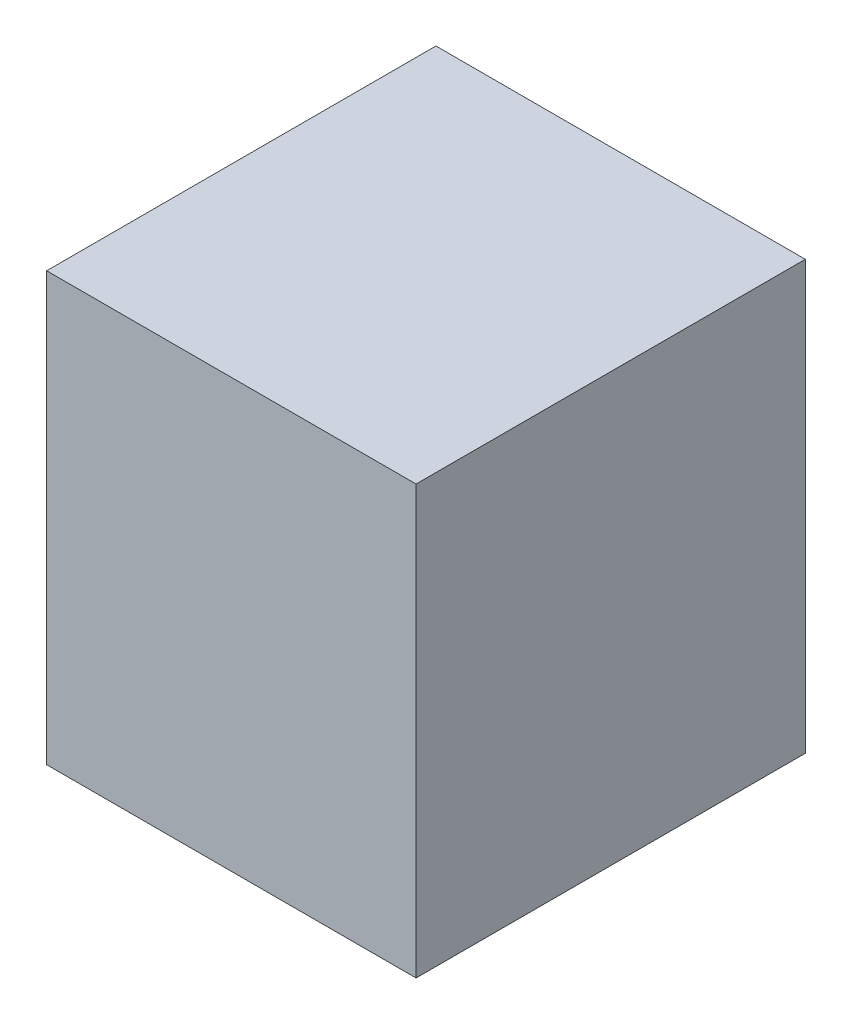
ISO-10303-21;
HEADER;
FILE_DESCRIPTION(('STEP AP214'),'2;1');
FILE_NAME('part.step','',(''),(''),'','','');
FILE_SCHEMA(('AUTOMOTIVE_DESIGN { 1 0 10303 214 1 1 1 1 }'));
ENDSEC;
DATA;
#1=APPLICATION_CONTEXT('core data for automotive mechanical design processes');
#2=APPLICATION_PROTOCOL_DEFINITION('international standard','automotive_design',2000,#1);
#3=PRODUCT_CONTEXT('',#1,'mechanical');
#4=PRODUCT('Part','Part','',(#3));
#5=PRODUCT_RELATED_PRODUCT_CATEGORY('part','',(#4));
#6=PRODUCT_DEFINITION_FORMATION('','',#4);
#7=PRODUCT_DEFINITION_CONTEXT('part definition',#1,'design');
#8=PRODUCT_DEFINITION('design','',#6,#7);
#9=PRODUCT_DEFINITION_SHAPE('','',#8);
#10=(LENGTH_UNIT() NAMED_UNIT(*) SI_UNIT(.MILLI.,.METRE.));
#11=(NAMED_UNIT(*) PLANE_ANGLE_UNIT() SI_UNIT($,.RADIAN.));
#12=(NAMED_UNIT(*) SI_UNIT($,.STERADIAN.) SOLID_ANGLE_UNIT());
#13=UNCERTAINTY_MEASURE_WITH_UNIT(LENGTH_MEASURE(1.E-05),#10,'distance_accuracy_value','');
#14=(GEOMETRIC_REPRESENTATION_CONTEXT(3) GLOBAL_UNCERTAINTY_ASSIGNED_CONTEXT((#13)) GLOBAL_UNIT_ASSIGNED_CONTEXT((#10,
#11,#12)) REPRESENTATION_CONTEXT('',''));
#15=CARTESIAN_POINT('',(0.,0.,0.));
#16=DIRECTION('',(0.,0.,1.));
#17=DIRECTION('',(1.,0.,0.));
#18=AXIS2_PLACEMENT_3D('',#15,#16,#17);
#19=CARTESIAN_POINT('',(-0.47449232,-0.5494909,0.));
#20=DIRECTION('',(-1.,0.,0.));
#21=DIRECTION('',(0.,0.,1.));
#22=AXIS2_PLACEMENT_3D('',#19,#20,#21);
#23=PLANE('',#22);
#24=DIRECTION('',(0.,0.,1.));
#25=VECTOR('',#24,1.);
#26=CARTESIAN_POINT('',(-0.47449232,0.5494909,0.));
#27=LINE('',#26,#25);
#28=CARTESIAN_POINT('',(-0.47449232,0.5494909,0.));
#29=VERTEX_POINT('',#28);
#30=CARTESIAN_POINT('',(-0.47449232,0.5494909,1.00000054));
#31=VERTEX_POINT('',#30);
#32=EDGE_CURVE('E20',#29,#31,#27,.T.);
#33=ORIENTED_EDGE('',*,*,#32,.F.);
#34=DIRECTION('',(0.,1.,0.));
#35=VECTOR('',#34,1.);
#36=CARTESIAN_POINT('',(-0.47449232,0.,0.));
#37=LINE('',#36,#35);
#38=CARTESIAN_POINT('',(-0.47449232,-0.5494909,0.));
#39=VERTEX_POINT('',#38);
#40=EDGE_CURVE('E81',#39,#29,#37,.T.);
#41=ORIENTED_EDGE('',*,*,#40,.F.);
#42=DIRECTION('',(0.,0.,-1.));
#43=VECTOR('',#42,1.);
#44=CARTESIAN_POINT('',(-0.47449232,-0.5494909,0.));
#45=LINE('',#44,#43);
#46=CARTESIAN_POINT('',(-0.47449232,-0.5494909,1.00000054));
#47=VERTEX_POINT('',#46);
#48=EDGE_CURVE('E68',#47,#39,#45,.T.);
#49=ORIENTED_EDGE('',*,*,#48,.F.);
#50=DIRECTION('',(0.,1.,0.));
#51=VECTOR('',#50,1.);
#52=CARTESIAN_POINT('',(-0.47449232,0.,1.00000054));
#53=LINE('',#52,#51);
#54=EDGE_CURVE('E55',#47,#31,#53,.T.);
#55=ORIENTED_EDGE('',*,*,#54,.T.);
#56=EDGE_LOOP('',(#33,#41,#49,#55));
#57=FACE_BOUND('',#56,.T.);
#58=ADVANCED_FACE('F17',(#57),#23,.T.);
#59=CARTESIAN_POINT('',(-0.47449232,0.5494909,0.));
#60=DIRECTION('',(0.,1.,0.));
#61=DIRECTION('',(0.,0.,1.));
#62=AXIS2_PLACEMENT_3D('',#59,#60,#61);
#63=PLANE('',#62);
#64=DIRECTION('',(0.,0.,-1.));
#65=VECTOR('',#64,1.);
#66=CARTESIAN_POINT('',(0.47449232,0.5494909,0.));
#67=LINE('',#66,#65);
#68=CARTESIAN_POINT('',(0.47449232,0.5494909,0.));
#69=VERTEX_POINT('',#68);
#70=CARTESIAN_POINT('',(0.47449232,0.5494909,1.00000054));
#71=VERTEX_POINT('',#70);
#72=EDGE_CURVE('E83',#69,#71,#67,.F.);
#73=ORIENTED_EDGE('',*,*,#72,.F.);
#74=DIRECTION('',(-1.,0.,0.));
#75=VECTOR('',#74,1.);
#76=CARTESIAN_POINT('',(0.,0.5494909,0.));
#77=LINE('',#76,#75);
#78=EDGE_CURVE('E64',#29,#69,#77,.F.);
#79=ORIENTED_EDGE('',*,*,#78,.F.);
#80=ORIENTED_EDGE('',*,*,#32,.T.);
#81=DIRECTION('',(-1.,0.,0.));
#82=VECTOR('',#81,1.);
#83=CARTESIAN_POINT('',(0.,0.5494909,1.00000054));
#84=LINE('',#83,#82);
#85=EDGE_CURVE('E61',#31,#71,#84,.F.);
#86=ORIENTED_EDGE('',*,*,#85,.T.);
#87=EDGE_LOOP('',(#73,#79,#80,#86));
#88=FACE_BOUND('',#87,.T.);
#89=ADVANCED_FACE('F60',(#88),#63,.T.);
#90=CARTESIAN_POINT('',(0.,0.,1.00000054));
#91=DIRECTION('',(0.,0.,-1.));
#92=DIRECTION('',(-1.,0.,0.));
#93=AXIS2_PLACEMENT_3D('',#90,#91,#92);
#94=PLANE('',#93);
#95=DIRECTION('',(1.,0.,0.));
#96=VECTOR('',#95,1.);
#97=CARTESIAN_POINT('',(0.47449232,-0.5494909,1.00000054));
#98=LINE('',#97,#96);
#99=CARTESIAN_POINT('',(0.47449232,-0.5494909,1.00000054));
#100=VERTEX_POINT('',#99);
#101=EDGE_CURVE('E70',#100,#47,#98,.F.);
#102=ORIENTED_EDGE('',*,*,#101,.F.);
#103=DIRECTION('',(0.,1.,0.));
#104=VECTOR('',#103,1.);
#105=CARTESIAN_POINT('',(0.47449232,0.5494909,1.00000054));
#106=LINE('',#105,#104);
#107=EDGE_CURVE('E74',#71,#100,#106,.F.);
#108=ORIENTED_EDGE('',*,*,#107,.F.);
#109=ORIENTED_EDGE('',*,*,#85,.F.);
#110=ORIENTED_EDGE('',*,*,#54,.F.);
#111=EDGE_LOOP('',(#102,#108,#109,#110));
#112=FACE_BOUND('',#111,.T.);
#113=ADVANCED_FACE('F72',(#112),#94,.F.);
#114=CARTESIAN_POINT('',(0.47449232,-0.5494909,0.));
#115=DIRECTION('',(0.,-1.,0.));
#116=DIRECTION('',(0.,0.,-1.));
#117=AXIS2_PLACEMENT_3D('',#114,#115,#116);
#118=PLANE('',#117);
#119=ORIENTED_EDGE('',*,*,#48,.T.);
#120=DIRECTION('',(-1.,0.,0.));
#121=VECTOR('',#120,1.);
#122=CARTESIAN_POINT('',(0.,-0.5494909,0.));
#123=LINE('',#122,#121);
#124=CARTESIAN_POINT('',(0.47449232,-0.5494909,0.));
#125=VERTEX_POINT('',#124);
#126=EDGE_CURVE('E35',#125,#39,#123,.T.);
#127=ORIENTED_EDGE('',*,*,#126,.F.);
#128=DIRECTION('',(0.,0.,-1.));
#129=VECTOR('',#128,1.);
#130=CARTESIAN_POINT('',(0.47449232,-0.5494909,0.));
#131=LINE('',#130,#129);
#132=EDGE_CURVE('E26',#100,#125,#131,.T.);
#133=ORIENTED_EDGE('',*,*,#132,.F.);
#134=ORIENTED_EDGE('',*,*,#101,.T.);
#135=EDGE_LOOP('',(#119,#127,#133,#134));
#136=FACE_BOUND('',#135,.T.);
#137=ADVANCED_FACE('F89',(#136),#118,.T.);
#138=CARTESIAN_POINT('',(0.,0.,0.));
#139=DIRECTION('',(0.,0.,-1.));
#140=DIRECTION('',(-1.,0.,0.));
#141=AXIS2_PLACEMENT_3D('',#138,#139,#140);
#142=PLANE('',#141);
#143=ORIENTED_EDGE('',*,*,#126,.T.);
#144=ORIENTED_EDGE('',*,*,#40,.T.);
#145=ORIENTED_EDGE('',*,*,#78,.T.);
#146=DIRECTION('',(0.,1.,0.));
#147=VECTOR('',#146,1.);
#148=CARTESIAN_POINT('',(0.47449232,0.5494909,0.));
#149=LINE('',#148,#147);
#150=EDGE_CURVE('E11',#125,#69,#149,.T.);
#151=ORIENTED_EDGE('',*,*,#150,.F.);
#152=EDGE_LOOP('',(#143,#144,#145,#151));
#153=FACE_BOUND('',#152,.T.);
#154=ADVANCED_FACE('F91',(#153),#142,.T.);
#155=CARTESIAN_POINT('',(0.47449232,0.5494909,0.));
#156=DIRECTION('',(1.,0.,0.));
#157=DIRECTION('',(0.,0.,-1.));
#158=AXIS2_PLACEMENT_3D('',#155,#156,#157);
#159=PLANE('',#158);
#160=ORIENTED_EDGE('',*,*,#132,.T.);
#161=ORIENTED_EDGE('',*,*,#150,.T.);
#162=ORIENTED_EDGE('',*,*,#72,.T.);
#163=ORIENTED_EDGE('',*,*,#107,.T.);
#164=EDGE_LOOP('',(#160,#161,#162,#163));
#165=FACE_BOUND('',#164,.T.);
#166=ADVANCED_FACE('F88',(#165),#159,.T.);
#167=CLOSED_SHELL('',(#58,#89,#113,#137,#154,#166));
#168=MANIFOLD_SOLID_BREP('B1',#167);
#169=ADVANCED_BREP_SHAPE_REPRESENTATION('',(#18,#168),#14);
#170=SHAPE_DEFINITION_REPRESENTATION(#9,#169);
ENDSEC;
END-ISO-10303-21;
